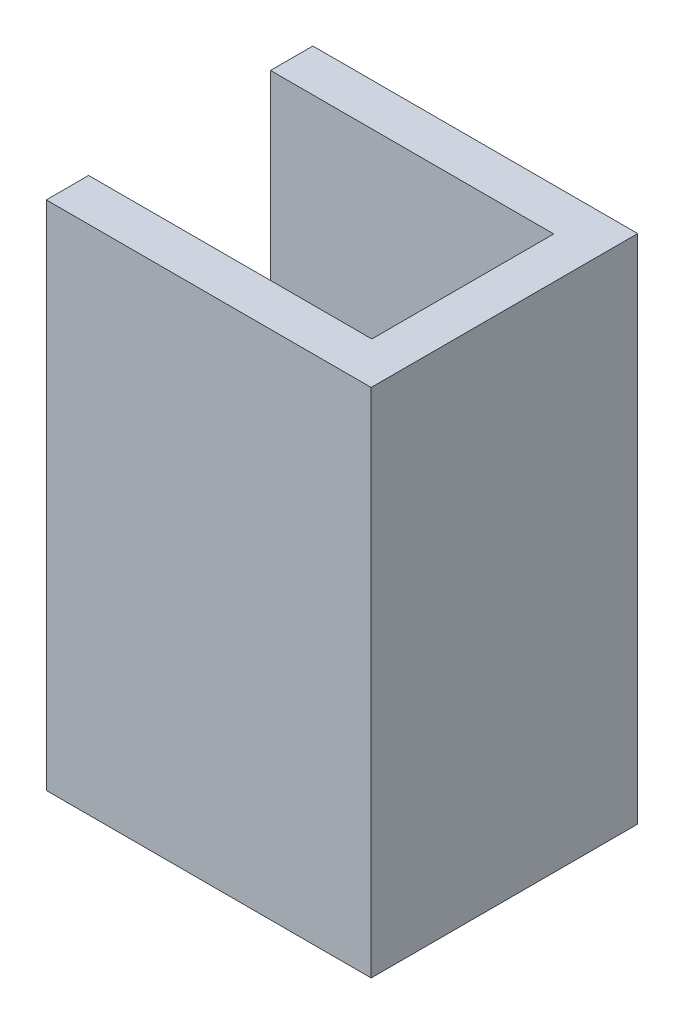
ISO-10303-21;
HEADER;
FILE_DESCRIPTION(('STEP AP214'),'2;1');
FILE_NAME('part.step','',(''),(''),'','','');
FILE_SCHEMA(('AUTOMOTIVE_DESIGN { 1 0 10303 214 1 1 1 1 }'));
ENDSEC;
DATA;
#1=APPLICATION_CONTEXT('core data for automotive mechanical design processes');
#2=APPLICATION_PROTOCOL_DEFINITION('international standard','automotive_design',2000,#1);
#3=PRODUCT_CONTEXT('',#1,'mechanical');
#4=PRODUCT('Part','Part','',(#3));
#5=PRODUCT_RELATED_PRODUCT_CATEGORY('part','',(#4));
#6=PRODUCT_DEFINITION_FORMATION('','',#4);
#7=PRODUCT_DEFINITION_CONTEXT('part definition',#1,'design');
#8=PRODUCT_DEFINITION('design','',#6,#7);
#9=PRODUCT_DEFINITION_SHAPE('','',#8);
#10=(LENGTH_UNIT() NAMED_UNIT(*) SI_UNIT(.MILLI.,.METRE.));
#11=(NAMED_UNIT(*) PLANE_ANGLE_UNIT() SI_UNIT($,.RADIAN.));
#12=(NAMED_UNIT(*) SI_UNIT($,.STERADIAN.) SOLID_ANGLE_UNIT());
#13=UNCERTAINTY_MEASURE_WITH_UNIT(LENGTH_MEASURE(1.E-05),#10,'distance_accuracy_value','');
#14=(GEOMETRIC_REPRESENTATION_CONTEXT(3) GLOBAL_UNCERTAINTY_ASSIGNED_CONTEXT((#13)) GLOBAL_UNIT_ASSIGNED_CONTEXT((#10,
#11,#12)) REPRESENTATION_CONTEXT('',''));
#15=CARTESIAN_POINT('',(0.,0.,0.));
#16=DIRECTION('',(0.,0.,1.));
#17=DIRECTION('',(1.,0.,0.));
#18=AXIS2_PLACEMENT_3D('',#15,#16,#17);
#19=CARTESIAN_POINT('',(-9.75,0.,0.));
#20=DIRECTION('',(1.,0.,0.));
#21=DIRECTION('',(0.,0.,-1.));
#22=AXIS2_PLACEMENT_3D('',#19,#20,#21);
#23=PLANE('',#22);
#24=DIRECTION('',(0.,0.,-1.));
#25=VECTOR('',#24,1.);
#26=CARTESIAN_POINT('',(-9.75,-15.35,-8.));
#27=LINE('',#26,#25);
#28=CARTESIAN_POINT('',(-9.75,-15.35,-5.46));
#29=VERTEX_POINT('',#28);
#30=CARTESIAN_POINT('',(-9.75,-15.35,-8.));
#31=VERTEX_POINT('',#30);
#32=EDGE_CURVE('E177',#29,#31,#27,.T.);
#33=ORIENTED_EDGE('',*,*,#32,.F.);
#34=DIRECTION('',(0.,-1.,0.));
#35=VECTOR('',#34,1.);
#36=CARTESIAN_POINT('',(-9.75,15.35,-5.46));
#37=LINE('',#36,#35);
#38=CARTESIAN_POINT('',(-9.75,15.35,-5.46));
#39=VERTEX_POINT('',#38);
#40=EDGE_CURVE('E117',#39,#29,#37,.T.);
#41=ORIENTED_EDGE('',*,*,#40,.F.);
#42=DIRECTION('',(0.,0.,1.));
#43=VECTOR('',#42,1.);
#44=CARTESIAN_POINT('',(-9.75,15.35,-8.));
#45=LINE('',#44,#43);
#46=CARTESIAN_POINT('',(-9.75,15.35,-8.));
#47=VERTEX_POINT('',#46);
#48=EDGE_CURVE('E168',#47,#39,#45,.T.);
#49=ORIENTED_EDGE('',*,*,#48,.F.);
#50=DIRECTION('',(0.,1.,0.));
#51=VECTOR('',#50,1.);
#52=CARTESIAN_POINT('',(-9.75,-15.35,-8.));
#53=LINE('',#52,#51);
#54=EDGE_CURVE('E180',#31,#47,#53,.T.);
#55=ORIENTED_EDGE('',*,*,#54,.F.);
#56=EDGE_LOOP('',(#33,#41,#49,#55));
#57=FACE_BOUND('',#56,.T.);
#58=ADVANCED_FACE('F37',(#57),#23,.F.);
#59=CARTESIAN_POINT('',(7.25,-13.75,-5.46));
#60=DIRECTION('',(0.,-1.,0.));
#61=DIRECTION('',(0.,0.,-1.));
#62=AXIS2_PLACEMENT_3D('',#59,#60,#61);
#63=PLANE('',#62);
#64=CARTESIAN_POINT('',(1.27,-13.75,0.));
#65=DIRECTION('',(0.,-1.,0.));
#66=DIRECTION('',(0.,0.,-1.));
#67=AXIS2_PLACEMENT_3D('',#64,#65,#66);
#68=CIRCLE('',#67,2.);
#69=CARTESIAN_POINT('',(1.27,-13.75,-2.));
#70=VERTEX_POINT('',#69);
#71=EDGE_CURVE('E127',#70,#70,#68,.F.);
#72=ORIENTED_EDGE('',*,*,#71,.F.);
#73=EDGE_LOOP('',(#72));
#74=FACE_BOUND('',#73,.T.);
#75=DIRECTION('',(0.,0.,-1.));
#76=VECTOR('',#75,1.);
#77=CARTESIAN_POINT('',(-4.67,-13.75,-5.46));
#78=LINE('',#77,#76);
#79=CARTESIAN_POINT('',(-4.67,-13.75,5.46));
#80=VERTEX_POINT('',#79);
#81=CARTESIAN_POINT('',(-4.67,-13.75,-5.46));
#82=VERTEX_POINT('',#81);
#83=EDGE_CURVE('E52',#80,#82,#78,.T.);
#84=ORIENTED_EDGE('',*,*,#83,.F.);
#85=DIRECTION('',(-1.,0.,0.));
#86=VECTOR('',#85,1.);
#87=CARTESIAN_POINT('',(7.25,-13.75,5.46));
#88=LINE('',#87,#86);
#89=CARTESIAN_POINT('',(7.25,-13.75,5.46));
#90=VERTEX_POINT('',#89);
#91=EDGE_CURVE('E158',#90,#80,#88,.T.);
#92=ORIENTED_EDGE('',*,*,#91,.F.);
#93=DIRECTION('',(0.,0.,1.));
#94=VECTOR('',#93,1.);
#95=CARTESIAN_POINT('',(7.25,-13.75,-5.46));
#96=LINE('',#95,#94);
#97=CARTESIAN_POINT('',(7.25,-13.75,-5.46));
#98=VERTEX_POINT('',#97);
#99=EDGE_CURVE('E146',#98,#90,#96,.T.);
#100=ORIENTED_EDGE('',*,*,#99,.F.);
#101=DIRECTION('',(-1.,0.,0.));
#102=VECTOR('',#101,1.);
#103=CARTESIAN_POINT('',(7.25,-13.75,-5.46));
#104=LINE('',#103,#102);
#105=EDGE_CURVE('E161',#98,#82,#104,.T.);
#106=ORIENTED_EDGE('',*,*,#105,.T.);
#107=EDGE_LOOP('',(#84,#92,#100,#106));
#108=FACE_BOUND('',#107,.T.);
#109=ADVANCED_FACE('F216',(#74,#108),#63,.F.);
#110=CARTESIAN_POINT('',(9.75,-15.35,8.));
#111=DIRECTION('',(0.,0.,-1.));
#112=DIRECTION('',(-1.,0.,0.));
#113=AXIS2_PLACEMENT_3D('',#110,#111,#112);
#114=PLANE('',#113);
#115=DIRECTION('',(0.,-1.,0.));
#116=VECTOR('',#115,1.);
#117=CARTESIAN_POINT('',(-9.75,-15.35,8.));
#118=LINE('',#117,#116);
#119=CARTESIAN_POINT('',(-9.75,15.35,8.));
#120=VERTEX_POINT('',#119);
#121=CARTESIAN_POINT('',(-9.75,-15.35,8.));
#122=VERTEX_POINT('',#121);
#123=EDGE_CURVE('E157',#120,#122,#118,.T.);
#124=ORIENTED_EDGE('',*,*,#123,.T.);
#125=DIRECTION('',(-1.,0.,0.));
#126=VECTOR('',#125,1.);
#127=CARTESIAN_POINT('',(9.75,-15.35,8.));
#128=LINE('',#127,#126);
#129=CARTESIAN_POINT('',(9.75,-15.35,8.));
#130=VERTEX_POINT('',#129);
#131=EDGE_CURVE('E11',#130,#122,#128,.T.);
#132=ORIENTED_EDGE('',*,*,#131,.F.);
#133=DIRECTION('',(0.,-1.,0.));
#134=VECTOR('',#133,1.);
#135=CARTESIAN_POINT('',(9.75,-15.35,8.));
#136=LINE('',#135,#134);
#137=CARTESIAN_POINT('',(9.75,15.35,8.));
#138=VERTEX_POINT('',#137);
#139=EDGE_CURVE('E164',#138,#130,#136,.T.);
#140=ORIENTED_EDGE('',*,*,#139,.F.);
#141=DIRECTION('',(-1.,0.,0.));
#142=VECTOR('',#141,1.);
#143=CARTESIAN_POINT('',(9.75,15.35,8.));
#144=LINE('',#143,#142);
#145=EDGE_CURVE('E174',#138,#120,#144,.T.);
#146=ORIENTED_EDGE('',*,*,#145,.T.);
#147=EDGE_LOOP('',(#124,#132,#140,#146));
#148=FACE_BOUND('',#147,.T.);
#149=ADVANCED_FACE('F39',(#148),#114,.F.);
#150=CARTESIAN_POINT('',(9.75,-15.35,-8.));
#151=DIRECTION('',(0.,1.,0.));
#152=DIRECTION('',(0.,0.,1.));
#153=AXIS2_PLACEMENT_3D('',#150,#151,#152);
#154=PLANE('',#153);
#155=CARTESIAN_POINT('',(1.27,-15.35,0.));
#156=DIRECTION('',(0.,-1.,0.));
#157=DIRECTION('',(0.,0.,-1.));
#158=AXIS2_PLACEMENT_3D('',#155,#156,#157);
#159=CIRCLE('',#158,2.);
#160=CARTESIAN_POINT('',(1.27,-15.35,-2.));
#161=VERTEX_POINT('',#160);
#162=EDGE_CURVE('E258',#161,#161,#159,.T.);
#163=ORIENTED_EDGE('',*,*,#162,.F.);
#164=EDGE_LOOP('',(#163));
#165=FACE_BOUND('',#164,.T.);
#166=DIRECTION('',(0.,0.,1.));
#167=VECTOR('',#166,1.);
#168=CARTESIAN_POINT('',(-4.67,-15.35,-5.46));
#169=LINE('',#168,#167);
#170=CARTESIAN_POINT('',(-4.67,-15.35,-5.46));
#171=VERTEX_POINT('',#170);
#172=CARTESIAN_POINT('',(-4.67,-15.35,5.46));
#173=VERTEX_POINT('',#172);
#174=EDGE_CURVE('E125',#171,#173,#169,.T.);
#175=ORIENTED_EDGE('',*,*,#174,.F.);
#176=DIRECTION('',(-1.,0.,0.));
#177=VECTOR('',#176,1.);
#178=CARTESIAN_POINT('',(-4.67,-15.35,-5.46));
#179=LINE('',#178,#177);
#180=EDGE_CURVE('E113',#171,#29,#179,.T.);
#181=ORIENTED_EDGE('',*,*,#180,.T.);
#182=ORIENTED_EDGE('',*,*,#32,.T.);
#183=DIRECTION('',(-1.,0.,0.));
#184=VECTOR('',#183,1.);
#185=CARTESIAN_POINT('',(9.75,-15.35,-8.));
#186=LINE('',#185,#184);
#187=CARTESIAN_POINT('',(9.75,-15.35,-8.));
#188=VERTEX_POINT('',#187);
#189=EDGE_CURVE('E45',#188,#31,#186,.T.);
#190=ORIENTED_EDGE('',*,*,#189,.F.);
#191=DIRECTION('',(0.,0.,-1.));
#192=VECTOR('',#191,1.);
#193=CARTESIAN_POINT('',(9.75,-15.35,-8.));
#194=LINE('',#193,#192);
#195=EDGE_CURVE('E167',#130,#188,#194,.T.);
#196=ORIENTED_EDGE('',*,*,#195,.F.);
#197=ORIENTED_EDGE('',*,*,#131,.T.);
#198=CARTESIAN_POINT('',(-9.75,-15.35,5.46));
#199=VERTEX_POINT('',#198);
#200=EDGE_CURVE('E178',#122,#199,#27,.T.);
#201=ORIENTED_EDGE('',*,*,#200,.T.);
#202=DIRECTION('',(-1.,0.,0.));
#203=VECTOR('',#202,1.);
#204=CARTESIAN_POINT('',(-4.67,-15.35,5.46));
#205=LINE('',#204,#203);
#206=EDGE_CURVE('E121',#173,#199,#205,.T.);
#207=ORIENTED_EDGE('',*,*,#206,.F.);
#208=EDGE_LOOP('',(#175,#181,#182,#190,#196,#197,#201,#207));
#209=FACE_BOUND('',#208,.T.);
#210=ADVANCED_FACE('F129',(#165,#209),#154,.F.);
#211=CARTESIAN_POINT('',(9.75,-15.35,-8.));
#212=DIRECTION('',(0.,0.,1.));
#213=DIRECTION('',(1.,0.,0.));
#214=AXIS2_PLACEMENT_3D('',#211,#212,#213);
#215=PLANE('',#214);
#216=ORIENTED_EDGE('',*,*,#54,.T.);
#217=DIRECTION('',(-1.,0.,0.));
#218=VECTOR('',#217,1.);
#219=CARTESIAN_POINT('',(9.75,15.35,-8.));
#220=LINE('',#219,#218);
#221=CARTESIAN_POINT('',(9.75,15.35,-8.));
#222=VERTEX_POINT('',#221);
#223=EDGE_CURVE('E187',#222,#47,#220,.T.);
#224=ORIENTED_EDGE('',*,*,#223,.F.);
#225=DIRECTION('',(0.,1.,0.));
#226=VECTOR('',#225,1.);
#227=CARTESIAN_POINT('',(9.75,-15.35,-8.));
#228=LINE('',#227,#226);
#229=EDGE_CURVE('E170',#188,#222,#228,.T.);
#230=ORIENTED_EDGE('',*,*,#229,.F.);
#231=ORIENTED_EDGE('',*,*,#189,.T.);
#232=EDGE_LOOP('',(#216,#224,#230,#231));
#233=FACE_BOUND('',#232,.T.);
#234=ADVANCED_FACE('F194',(#233),#215,.F.);
#235=CARTESIAN_POINT('',(9.75,15.35,-8.));
#236=DIRECTION('',(0.,-1.,0.));
#237=DIRECTION('',(0.,0.,-1.));
#238=AXIS2_PLACEMENT_3D('',#235,#236,#237);
#239=PLANE('',#238);
#240=DIRECTION('',(0.,0.,-1.));
#241=VECTOR('',#240,1.);
#242=CARTESIAN_POINT('',(7.25,15.35,-5.46));
#243=LINE('',#242,#241);
#244=CARTESIAN_POINT('',(7.25,15.35,5.46));
#245=VERTEX_POINT('',#244);
#246=CARTESIAN_POINT('',(7.25,15.35,-5.46));
#247=VERTEX_POINT('',#246);
#248=EDGE_CURVE('E139',#245,#247,#243,.T.);
#249=ORIENTED_EDGE('',*,*,#248,.F.);
#250=DIRECTION('',(-1.,0.,0.));
#251=VECTOR('',#250,1.);
#252=CARTESIAN_POINT('',(7.25,15.35,5.46));
#253=LINE('',#252,#251);
#254=CARTESIAN_POINT('',(-9.75,15.35,5.46));
#255=VERTEX_POINT('',#254);
#256=EDGE_CURVE('E154',#245,#255,#253,.T.);
#257=ORIENTED_EDGE('',*,*,#256,.T.);
#258=EDGE_CURVE('E182',#255,#120,#45,.T.);
#259=ORIENTED_EDGE('',*,*,#258,.T.);
#260=ORIENTED_EDGE('',*,*,#145,.F.);
#261=DIRECTION('',(0.,0.,1.));
#262=VECTOR('',#261,1.);
#263=CARTESIAN_POINT('',(9.75,15.35,-8.));
#264=LINE('',#263,#262);
#265=EDGE_CURVE('E172',#222,#138,#264,.T.);
#266=ORIENTED_EDGE('',*,*,#265,.F.);
#267=ORIENTED_EDGE('',*,*,#223,.T.);
#268=ORIENTED_EDGE('',*,*,#48,.T.);
#269=DIRECTION('',(-1.,0.,0.));
#270=VECTOR('',#269,1.);
#271=CARTESIAN_POINT('',(7.25,15.35,-5.46));
#272=LINE('',#271,#270);
#273=EDGE_CURVE('E60',#247,#39,#272,.T.);
#274=ORIENTED_EDGE('',*,*,#273,.F.);
#275=EDGE_LOOP('',(#249,#257,#259,#260,#266,#267,#268,#274));
#276=FACE_BOUND('',#275,.T.);
#277=ADVANCED_FACE('F200',(#276),#239,.F.);
#278=CARTESIAN_POINT('',(9.75,0.,0.));
#279=DIRECTION('',(1.,0.,0.));
#280=DIRECTION('',(0.,0.,-1.));
#281=AXIS2_PLACEMENT_3D('',#278,#279,#280);
#282=PLANE('',#281);
#283=ORIENTED_EDGE('',*,*,#139,.T.);
#284=ORIENTED_EDGE('',*,*,#195,.T.);
#285=ORIENTED_EDGE('',*,*,#229,.T.);
#286=ORIENTED_EDGE('',*,*,#265,.T.);
#287=EDGE_LOOP('',(#283,#284,#285,#286));
#288=FACE_BOUND('',#287,.T.);
#289=ADVANCED_FACE('F205',(#288),#282,.T.);
#290=DIRECTION('',(0.,1.,0.));
#291=VECTOR('',#290,1.);
#292=CARTESIAN_POINT('',(-9.75,-13.75,5.46));
#293=LINE('',#292,#291);
#294=EDGE_CURVE('E143',#199,#255,#293,.T.);
#295=ORIENTED_EDGE('',*,*,#294,.F.);
#296=ORIENTED_EDGE('',*,*,#200,.F.);
#297=ORIENTED_EDGE('',*,*,#123,.F.);
#298=ORIENTED_EDGE('',*,*,#258,.F.);
#299=EDGE_LOOP('',(#295,#296,#297,#298));
#300=FACE_BOUND('',#299,.T.);
#301=ADVANCED_FACE('F211',(#300),#23,.F.);
#302=CARTESIAN_POINT('',(7.25,-13.75,5.46));
#303=DIRECTION('',(0.,0.,1.));
#304=DIRECTION('',(1.,0.,0.));
#305=AXIS2_PLACEMENT_3D('',#302,#303,#304);
#306=PLANE('',#305);
#307=ORIENTED_EDGE('',*,*,#294,.T.);
#308=ORIENTED_EDGE('',*,*,#256,.F.);
#309=DIRECTION('',(0.,1.,0.));
#310=VECTOR('',#309,1.);
#311=CARTESIAN_POINT('',(7.25,-13.75,5.46));
#312=LINE('',#311,#310);
#313=EDGE_CURVE('E149',#90,#245,#312,.T.);
#314=ORIENTED_EDGE('',*,*,#313,.F.);
#315=ORIENTED_EDGE('',*,*,#91,.T.);
#316=DIRECTION('',(0.,1.,0.));
#317=VECTOR('',#316,1.);
#318=CARTESIAN_POINT('',(-4.67,-15.35,5.46));
#319=LINE('',#318,#317);
#320=EDGE_CURVE('E132',#173,#80,#319,.T.);
#321=ORIENTED_EDGE('',*,*,#320,.F.);
#322=ORIENTED_EDGE('',*,*,#206,.T.);
#323=EDGE_LOOP('',(#307,#308,#314,#315,#321,#322));
#324=FACE_BOUND('',#323,.T.);
#325=ADVANCED_FACE('F213',(#324),#306,.F.);
#326=CARTESIAN_POINT('',(7.25,15.35,-5.46));
#327=DIRECTION('',(0.,0.,-1.));
#328=DIRECTION('',(0.,1.,0.));
#329=AXIS2_PLACEMENT_3D('',#326,#327,#328);
#330=PLANE('',#329);
#331=ORIENTED_EDGE('',*,*,#40,.T.);
#332=ORIENTED_EDGE('',*,*,#180,.F.);
#333=DIRECTION('',(0.,-1.,0.));
#334=VECTOR('',#333,1.);
#335=CARTESIAN_POINT('',(-4.67,-13.75,-5.46));
#336=LINE('',#335,#334);
#337=EDGE_CURVE('E115',#82,#171,#336,.T.);
#338=ORIENTED_EDGE('',*,*,#337,.F.);
#339=ORIENTED_EDGE('',*,*,#105,.F.);
#340=DIRECTION('',(0.,-1.,0.));
#341=VECTOR('',#340,1.);
#342=CARTESIAN_POINT('',(7.25,15.35,-5.46));
#343=LINE('',#342,#341);
#344=EDGE_CURVE('E142',#247,#98,#343,.T.);
#345=ORIENTED_EDGE('',*,*,#344,.F.);
#346=ORIENTED_EDGE('',*,*,#273,.T.);
#347=EDGE_LOOP('',(#331,#332,#338,#339,#345,#346));
#348=FACE_BOUND('',#347,.T.);
#349=ADVANCED_FACE('F114',(#348),#330,.F.);
#350=CARTESIAN_POINT('',(7.25,0.,0.));
#351=DIRECTION('',(-1.,0.,0.));
#352=DIRECTION('',(0.,0.,1.));
#353=AXIS2_PLACEMENT_3D('',#350,#351,#352);
#354=PLANE('',#353);
#355=ORIENTED_EDGE('',*,*,#248,.T.);
#356=ORIENTED_EDGE('',*,*,#344,.T.);
#357=ORIENTED_EDGE('',*,*,#99,.T.);
#358=ORIENTED_EDGE('',*,*,#313,.T.);
#359=EDGE_LOOP('',(#355,#356,#357,#358));
#360=FACE_BOUND('',#359,.T.);
#361=ADVANCED_FACE('F219',(#360),#354,.T.);
#362=CARTESIAN_POINT('',(-4.67,0.,0.));
#363=DIRECTION('',(-1.,0.,0.));
#364=DIRECTION('',(0.,0.,1.));
#365=AXIS2_PLACEMENT_3D('',#362,#363,#364);
#366=PLANE('',#365);
#367=ORIENTED_EDGE('',*,*,#337,.T.);
#368=ORIENTED_EDGE('',*,*,#174,.T.);
#369=ORIENTED_EDGE('',*,*,#320,.T.);
#370=ORIENTED_EDGE('',*,*,#83,.T.);
#371=EDGE_LOOP('',(#367,#368,#369,#370));
#372=FACE_BOUND('',#371,.T.);
#373=ADVANCED_FACE('F124',(#372),#366,.T.);
#374=CARTESIAN_POINT('',(1.27,-8.09314575050762,0.));
#375=DIRECTION('',(0.,-1.,0.));
#376=DIRECTION('',(0.,0.,-1.));
#377=AXIS2_PLACEMENT_3D('',#374,#375,#376);
#378=CYLINDRICAL_SURFACE('',#377,2.);
#379=ORIENTED_EDGE('',*,*,#71,.T.);
#380=EDGE_LOOP('',(#379));
#381=FACE_BOUND('',#380,.T.);
#382=ORIENTED_EDGE('',*,*,#162,.T.);
#383=EDGE_LOOP('',(#382));
#384=FACE_BOUND('',#383,.T.);
#385=ADVANCED_FACE('F226',(#381,#384),#378,.F.);
#386=CLOSED_SHELL('',(#58,#109,#149,#210,#234,#277,#289,#301,#325,#349,#361,#373,#385));
#387=MANIFOLD_SOLID_BREP('B2',#386);
#388=ADVANCED_BREP_SHAPE_REPRESENTATION('',(#18,#387),#14);
#389=SHAPE_DEFINITION_REPRESENTATION(#9,#388);
ENDSEC;
END-ISO-10303-21;
